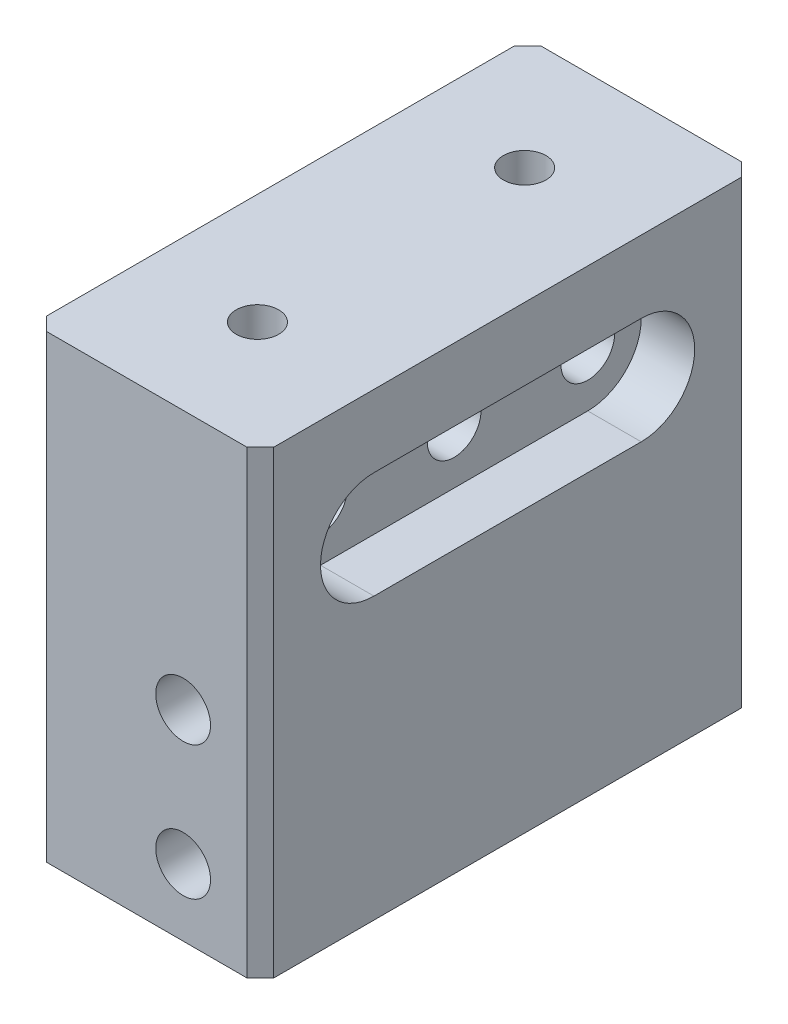
ISO-10303-21;
HEADER;
FILE_DESCRIPTION(('STEP AP214'),'2;1');
FILE_NAME('part.step','',(''),(''),'','','');
FILE_SCHEMA(('AUTOMOTIVE_DESIGN { 1 0 10303 214 1 1 1 1 }'));
ENDSEC;
DATA;
#1=APPLICATION_CONTEXT('core data for automotive mechanical design processes');
#2=APPLICATION_PROTOCOL_DEFINITION('international standard','automotive_design',2000,#1);
#3=PRODUCT_CONTEXT('',#1,'mechanical');
#4=PRODUCT('Part','Part','',(#3));
#5=PRODUCT_RELATED_PRODUCT_CATEGORY('part','',(#4));
#6=PRODUCT_DEFINITION_FORMATION('','',#4);
#7=PRODUCT_DEFINITION_CONTEXT('part definition',#1,'design');
#8=PRODUCT_DEFINITION('design','',#6,#7);
#9=PRODUCT_DEFINITION_SHAPE('','',#8);
#10=(LENGTH_UNIT() NAMED_UNIT(*) SI_UNIT(.MILLI.,.METRE.));
#11=(NAMED_UNIT(*) PLANE_ANGLE_UNIT() SI_UNIT($,.RADIAN.));
#12=(NAMED_UNIT(*) SI_UNIT($,.STERADIAN.) SOLID_ANGLE_UNIT());
#13=UNCERTAINTY_MEASURE_WITH_UNIT(LENGTH_MEASURE(1.E-05),#10,'distance_accuracy_value','');
#14=(GEOMETRIC_REPRESENTATION_CONTEXT(3) GLOBAL_UNCERTAINTY_ASSIGNED_CONTEXT((#13)) GLOBAL_UNIT_ASSIGNED_CONTEXT((#10,
#11,#12)) REPRESENTATION_CONTEXT('',''));
#15=CARTESIAN_POINT('',(0.,0.,0.));
#16=DIRECTION('',(0.,0.,1.));
#17=DIRECTION('',(1.,0.,0.));
#18=AXIS2_PLACEMENT_3D('',#15,#16,#17);
#19=CARTESIAN_POINT('',(-10.795,12.7,0.));
#20=DIRECTION('',(1.,0.,0.));
#21=DIRECTION('',(0.,0.,-1.));
#22=AXIS2_PLACEMENT_3D('',#19,#20,#21);
#23=CYLINDRICAL_SURFACE('',#22,2.5527);
#24=CARTESIAN_POINT('',(-10.795,12.7,0.));
#25=DIRECTION('',(1.,0.,0.));
#26=DIRECTION('',(0.,0.,-1.));
#27=AXIS2_PLACEMENT_3D('',#24,#25,#26);
#28=CIRCLE('',#27,2.5527);
#29=CARTESIAN_POINT('',(-10.795,12.7,-2.5527));
#30=VERTEX_POINT('',#29);
#31=EDGE_CURVE('E180',#30,#30,#28,.T.);
#32=ORIENTED_EDGE('',*,*,#31,.F.);
#33=EDGE_LOOP('',(#32));
#34=FACE_BOUND('',#33,.T.);
#35=CARTESIAN_POINT('',(5.715,12.7,0.));
#36=DIRECTION('',(1.,0.,0.));
#37=DIRECTION('',(0.,0.,-1.));
#38=AXIS2_PLACEMENT_3D('',#35,#36,#37);
#39=CIRCLE('',#38,2.5527);
#40=CARTESIAN_POINT('',(5.715,12.7,-2.5527));
#41=VERTEX_POINT('',#40);
#42=EDGE_CURVE('E177',#41,#41,#39,.F.);
#43=ORIENTED_EDGE('',*,*,#42,.F.);
#44=EDGE_LOOP('',(#43));
#45=FACE_BOUND('',#44,.T.);
#46=ADVANCED_FACE('F37',(#34,#45),#23,.F.);
#47=CARTESIAN_POINT('',(-10.795,12.7,-12.7));
#48=DIRECTION('',(1.,0.,0.));
#49=DIRECTION('',(0.,0.,-1.));
#50=AXIS2_PLACEMENT_3D('',#47,#48,#49);
#51=CYLINDRICAL_SURFACE('',#50,2.5527);
#52=CARTESIAN_POINT('',(-10.795,12.7,-12.7));
#53=DIRECTION('',(1.,0.,0.));
#54=DIRECTION('',(0.,0.,-1.));
#55=AXIS2_PLACEMENT_3D('',#52,#53,#54);
#56=CIRCLE('',#55,2.5527);
#57=CARTESIAN_POINT('',(-10.795,12.7,-15.2527));
#58=VERTEX_POINT('',#57);
#59=EDGE_CURVE('E185',#58,#58,#56,.T.);
#60=ORIENTED_EDGE('',*,*,#59,.F.);
#61=EDGE_LOOP('',(#60));
#62=FACE_BOUND('',#61,.T.);
#63=CARTESIAN_POINT('',(5.715,12.7,-12.7));
#64=DIRECTION('',(1.,0.,0.));
#65=DIRECTION('',(0.,0.,-1.));
#66=AXIS2_PLACEMENT_3D('',#63,#64,#65);
#67=CIRCLE('',#66,2.5527);
#68=CARTESIAN_POINT('',(5.715,12.7,-15.2527));
#69=VERTEX_POINT('',#68);
#70=EDGE_CURVE('E174',#69,#69,#67,.F.);
#71=ORIENTED_EDGE('',*,*,#70,.F.);
#72=EDGE_LOOP('',(#71));
#73=FACE_BOUND('',#72,.T.);
#74=ADVANCED_FACE('F309',(#62,#73),#51,.F.);
#75=CARTESIAN_POINT('',(-10.795,12.7,12.7));
#76=DIRECTION('',(1.,0.,0.));
#77=DIRECTION('',(0.,0.,-1.));
#78=AXIS2_PLACEMENT_3D('',#75,#76,#77);
#79=CYLINDRICAL_SURFACE('',#78,2.5527);
#80=CARTESIAN_POINT('',(-10.795,12.7,12.7));
#81=DIRECTION('',(1.,0.,0.));
#82=DIRECTION('',(0.,0.,-1.));
#83=AXIS2_PLACEMENT_3D('',#80,#81,#82);
#84=CIRCLE('',#83,2.5527);
#85=CARTESIAN_POINT('',(-10.795,12.7,10.1473));
#86=VERTEX_POINT('',#85);
#87=EDGE_CURVE('E181',#86,#86,#84,.T.);
#88=ORIENTED_EDGE('',*,*,#87,.F.);
#89=EDGE_LOOP('',(#88));
#90=FACE_BOUND('',#89,.T.);
#91=CARTESIAN_POINT('',(5.715,12.7,12.7));
#92=DIRECTION('',(1.,0.,0.));
#93=DIRECTION('',(0.,0.,-1.));
#94=AXIS2_PLACEMENT_3D('',#91,#92,#93);
#95=CIRCLE('',#94,2.5527);
#96=CARTESIAN_POINT('',(5.715,12.7,10.1473));
#97=VERTEX_POINT('',#96);
#98=EDGE_CURVE('E170',#97,#97,#95,.F.);
#99=ORIENTED_EDGE('',*,*,#98,.F.);
#100=EDGE_LOOP('',(#99));
#101=FACE_BOUND('',#100,.T.);
#102=ADVANCED_FACE('F315',(#90,#101),#79,.F.);
#103=CARTESIAN_POINT('',(10.795,19.05,23.495));
#104=DIRECTION('',(-1.,0.,0.));
#105=DIRECTION('',(0.,0.,1.));
#106=AXIS2_PLACEMENT_3D('',#103,#104,#105);
#107=PLANE('',#106);
#108=DIRECTION('',(0.,0.,-1.));
#109=VECTOR('',#108,1.);
#110=CARTESIAN_POINT('',(10.795,7.62,12.7));
#111=LINE('',#110,#109);
#112=CARTESIAN_POINT('',(10.795,7.62,12.7));
#113=VERTEX_POINT('',#112);
#114=CARTESIAN_POINT('',(10.795,7.62,-12.7));
#115=VERTEX_POINT('',#114);
#116=EDGE_CURVE('E164',#113,#115,#111,.T.);
#117=ORIENTED_EDGE('',*,*,#116,.F.);
#118=CARTESIAN_POINT('',(10.795,12.7,12.7));
#119=DIRECTION('',(1.,0.,0.));
#120=DIRECTION('',(0.,0.,-1.));
#121=AXIS2_PLACEMENT_3D('',#118,#119,#120);
#122=CIRCLE('',#121,5.08);
#123=CARTESIAN_POINT('',(10.795,17.78,12.7));
#124=VERTEX_POINT('',#123);
#125=EDGE_CURVE('E134',#124,#113,#122,.T.);
#126=ORIENTED_EDGE('',*,*,#125,.F.);
#127=DIRECTION('',(0.,0.,1.));
#128=VECTOR('',#127,1.);
#129=CARTESIAN_POINT('',(10.795,17.78,12.7));
#130=LINE('',#129,#128);
#131=CARTESIAN_POINT('',(10.795,17.78,-12.7));
#132=VERTEX_POINT('',#131);
#133=EDGE_CURVE('E152',#132,#124,#130,.T.);
#134=ORIENTED_EDGE('',*,*,#133,.F.);
#135=CARTESIAN_POINT('',(10.795,12.7,-12.7));
#136=DIRECTION('',(1.,0.,0.));
#137=DIRECTION('',(0.,0.,-1.));
#138=AXIS2_PLACEMENT_3D('',#135,#136,#137);
#139=CIRCLE('',#138,5.08);
#140=EDGE_CURVE('E155',#115,#132,#139,.T.);
#141=ORIENTED_EDGE('',*,*,#140,.F.);
#142=EDGE_LOOP('',(#117,#126,#134,#141));
#143=FACE_BOUND('',#142,.T.);
#144=DIRECTION('',(0.,0.,-1.));
#145=VECTOR('',#144,1.);
#146=CARTESIAN_POINT('',(10.795,24.638,23.495));
#147=LINE('',#146,#145);
#148=CARTESIAN_POINT('',(10.795,24.638,22.225));
#149=VERTEX_POINT('',#148);
#150=CARTESIAN_POINT('',(10.795,24.638,-22.225));
#151=VERTEX_POINT('',#150);
#152=EDGE_CURVE('E266',#149,#151,#147,.T.);
#153=ORIENTED_EDGE('',*,*,#152,.F.);
#154=DIRECTION('',(0.,-1.,0.));
#155=VECTOR('',#154,1.);
#156=CARTESIAN_POINT('',(10.795,19.05,22.225));
#157=LINE('',#156,#155);
#158=CARTESIAN_POINT('',(10.795,-19.05,22.225));
#159=VERTEX_POINT('',#158);
#160=EDGE_CURVE('E241',#149,#159,#157,.T.);
#161=ORIENTED_EDGE('',*,*,#160,.T.);
#162=DIRECTION('',(0.,0.,-1.));
#163=VECTOR('',#162,1.);
#164=CARTESIAN_POINT('',(10.795,-19.05,23.495));
#165=LINE('',#164,#163);
#166=CARTESIAN_POINT('',(10.795,-19.05,-22.225));
#167=VERTEX_POINT('',#166);
#168=EDGE_CURVE('E193',#159,#167,#165,.T.);
#169=ORIENTED_EDGE('',*,*,#168,.T.);
#170=DIRECTION('',(0.,1.,0.));
#171=VECTOR('',#170,1.);
#172=CARTESIAN_POINT('',(10.795,19.05,-22.225));
#173=LINE('',#172,#171);
#174=EDGE_CURVE('E239',#167,#151,#173,.T.);
#175=ORIENTED_EDGE('',*,*,#174,.T.);
#176=EDGE_LOOP('',(#153,#161,#169,#175));
#177=FACE_BOUND('',#176,.T.);
#178=ADVANCED_FACE('F341',(#143,#177),#107,.F.);
#179=CARTESIAN_POINT('',(-10.795,19.05,-23.495));
#180=DIRECTION('',(0.,0.,1.));
#181=DIRECTION('',(1.,0.,0.));
#182=AXIS2_PLACEMENT_3D('',#179,#180,#181);
#183=PLANE('',#182);
#184=CARTESIAN_POINT('',(3.4544,-12.7,-23.495));
#185=DIRECTION('',(0.,0.,1.));
#186=DIRECTION('',(1.,0.,0.));
#187=AXIS2_PLACEMENT_3D('',#184,#185,#186);
#188=CIRCLE('',#187,2.6035);
#189=CARTESIAN_POINT('',(6.05790000000001,-12.7,-23.495));
#190=VERTEX_POINT('',#189);
#191=EDGE_CURVE('E190',#190,#190,#188,.T.);
#192=ORIENTED_EDGE('',*,*,#191,.T.);
#193=EDGE_LOOP('',(#192));
#194=FACE_BOUND('',#193,.T.);
#195=CARTESIAN_POINT('',(3.4544,0.,-23.495));
#196=DIRECTION('',(0.,0.,1.));
#197=DIRECTION('',(1.,0.,0.));
#198=AXIS2_PLACEMENT_3D('',#195,#196,#197);
#199=CIRCLE('',#198,2.6035);
#200=CARTESIAN_POINT('',(6.05790000000001,0.,-23.495));
#201=VERTEX_POINT('',#200);
#202=EDGE_CURVE('E197',#201,#201,#199,.T.);
#203=ORIENTED_EDGE('',*,*,#202,.T.);
#204=EDGE_LOOP('',(#203));
#205=FACE_BOUND('',#204,.T.);
#206=DIRECTION('',(-1.,0.,0.));
#207=VECTOR('',#206,1.);
#208=CARTESIAN_POINT('',(-10.795,-19.05,-23.495));
#209=LINE('',#208,#207);
#210=CARTESIAN_POINT('',(9.52499999999999,-19.05,-23.495));
#211=VERTEX_POINT('',#210);
#212=CARTESIAN_POINT('',(-9.525,-19.05,-23.495));
#213=VERTEX_POINT('',#212);
#214=EDGE_CURVE('E204',#211,#213,#209,.T.);
#215=ORIENTED_EDGE('',*,*,#214,.T.);
#216=DIRECTION('',(0.,1.,0.));
#217=VECTOR('',#216,1.);
#218=CARTESIAN_POINT('',(-9.525,19.05,-23.495));
#219=LINE('',#218,#217);
#220=CARTESIAN_POINT('',(-9.525,24.638,-23.495));
#221=VERTEX_POINT('',#220);
#222=EDGE_CURVE('E11',#213,#221,#219,.T.);
#223=ORIENTED_EDGE('',*,*,#222,.T.);
#224=DIRECTION('',(-1.,0.,0.));
#225=VECTOR('',#224,1.);
#226=CARTESIAN_POINT('',(10.795,24.638,-23.495));
#227=LINE('',#226,#225);
#228=CARTESIAN_POINT('',(9.52499999999999,24.638,-23.495));
#229=VERTEX_POINT('',#228);
#230=EDGE_CURVE('E247',#229,#221,#227,.T.);
#231=ORIENTED_EDGE('',*,*,#230,.F.);
#232=DIRECTION('',(0.,-1.,0.));
#233=VECTOR('',#232,1.);
#234=CARTESIAN_POINT('',(9.52499999999999,19.05,-23.495));
#235=LINE('',#234,#233);
#236=EDGE_CURVE('E46',#229,#211,#235,.T.);
#237=ORIENTED_EDGE('',*,*,#236,.T.);
#238=EDGE_LOOP('',(#215,#223,#231,#237));
#239=FACE_BOUND('',#238,.T.);
#240=ADVANCED_FACE('F246',(#194,#205,#239),#183,.F.);
#241=CARTESIAN_POINT('',(-10.795,19.05,23.495));
#242=DIRECTION('',(1.,0.,0.));
#243=DIRECTION('',(0.,0.,-1.));
#244=AXIS2_PLACEMENT_3D('',#241,#242,#243);
#245=PLANE('',#244);
#246=ORIENTED_EDGE('',*,*,#87,.T.);
#247=EDGE_LOOP('',(#246));
#248=FACE_BOUND('',#247,.T.);
#249=ORIENTED_EDGE('',*,*,#59,.T.);
#250=EDGE_LOOP('',(#249));
#251=FACE_BOUND('',#250,.T.);
#252=ORIENTED_EDGE('',*,*,#31,.T.);
#253=EDGE_LOOP('',(#252));
#254=FACE_BOUND('',#253,.T.);
#255=DIRECTION('',(0.,0.,1.));
#256=VECTOR('',#255,1.);
#257=CARTESIAN_POINT('',(-10.795,-19.05,23.495));
#258=LINE('',#257,#256);
#259=CARTESIAN_POINT('',(-10.795,-19.05,-22.225));
#260=VERTEX_POINT('',#259);
#261=CARTESIAN_POINT('',(-10.795,-19.05,22.225));
#262=VERTEX_POINT('',#261);
#263=EDGE_CURVE('E206',#260,#262,#258,.T.);
#264=ORIENTED_EDGE('',*,*,#263,.T.);
#265=DIRECTION('',(0.,1.,0.));
#266=VECTOR('',#265,1.);
#267=CARTESIAN_POINT('',(-10.795,19.05,22.225));
#268=LINE('',#267,#266);
#269=CARTESIAN_POINT('',(-10.795,24.638,22.225));
#270=VERTEX_POINT('',#269);
#271=EDGE_CURVE('E230',#262,#270,#268,.T.);
#272=ORIENTED_EDGE('',*,*,#271,.T.);
#273=DIRECTION('',(0.,0.,1.));
#274=VECTOR('',#273,1.);
#275=CARTESIAN_POINT('',(-10.795,24.638,-23.495));
#276=LINE('',#275,#274);
#277=CARTESIAN_POINT('',(-10.795,24.638,-22.225));
#278=VERTEX_POINT('',#277);
#279=EDGE_CURVE('E263',#278,#270,#276,.T.);
#280=ORIENTED_EDGE('',*,*,#279,.F.);
#281=DIRECTION('',(0.,-1.,0.));
#282=VECTOR('',#281,1.);
#283=CARTESIAN_POINT('',(-10.795,19.05,-22.225));
#284=LINE('',#283,#282);
#285=EDGE_CURVE('E227',#278,#260,#284,.T.);
#286=ORIENTED_EDGE('',*,*,#285,.T.);
#287=EDGE_LOOP('',(#264,#272,#280,#286));
#288=FACE_BOUND('',#287,.T.);
#289=ADVANCED_FACE('F260',(#248,#251,#254,#288),#245,.F.);
#290=CARTESIAN_POINT('',(-10.795,19.05,23.495));
#291=DIRECTION('',(0.,0.,-1.));
#292=DIRECTION('',(-1.,0.,0.));
#293=AXIS2_PLACEMENT_3D('',#290,#291,#292);
#294=PLANE('',#293);
#295=CARTESIAN_POINT('',(3.4544,-12.7,23.495));
#296=DIRECTION('',(0.,0.,1.));
#297=DIRECTION('',(1.,0.,0.));
#298=AXIS2_PLACEMENT_3D('',#295,#296,#297);
#299=CIRCLE('',#298,2.6035);
#300=CARTESIAN_POINT('',(6.05790000000001,-12.7,23.495));
#301=VERTEX_POINT('',#300);
#302=EDGE_CURVE('E194',#301,#301,#299,.T.);
#303=ORIENTED_EDGE('',*,*,#302,.F.);
#304=EDGE_LOOP('',(#303));
#305=FACE_BOUND('',#304,.T.);
#306=CARTESIAN_POINT('',(3.4544,0.,23.495));
#307=DIRECTION('',(0.,0.,1.));
#308=DIRECTION('',(1.,0.,0.));
#309=AXIS2_PLACEMENT_3D('',#306,#307,#308);
#310=CIRCLE('',#309,2.6035);
#311=CARTESIAN_POINT('',(6.05790000000001,0.,23.495));
#312=VERTEX_POINT('',#311);
#313=EDGE_CURVE('E184',#312,#312,#310,.T.);
#314=ORIENTED_EDGE('',*,*,#313,.F.);
#315=EDGE_LOOP('',(#314));
#316=FACE_BOUND('',#315,.T.);
#317=DIRECTION('',(1.,0.,0.));
#318=VECTOR('',#317,1.);
#319=CARTESIAN_POINT('',(-10.795,24.638,23.495));
#320=LINE('',#319,#318);
#321=CARTESIAN_POINT('',(-9.52499999999999,24.638,23.495));
#322=VERTEX_POINT('',#321);
#323=CARTESIAN_POINT('',(9.52500000000001,24.638,23.495));
#324=VERTEX_POINT('',#323);
#325=EDGE_CURVE('E158',#322,#324,#320,.T.);
#326=ORIENTED_EDGE('',*,*,#325,.F.);
#327=DIRECTION('',(0.,-1.,0.));
#328=VECTOR('',#327,1.);
#329=CARTESIAN_POINT('',(-9.52499999999999,19.05,23.495));
#330=LINE('',#329,#328);
#331=CARTESIAN_POINT('',(-9.52499999999999,-19.05,23.495));
#332=VERTEX_POINT('',#331);
#333=EDGE_CURVE('E216',#322,#332,#330,.T.);
#334=ORIENTED_EDGE('',*,*,#333,.T.);
#335=DIRECTION('',(1.,0.,0.));
#336=VECTOR('',#335,1.);
#337=CARTESIAN_POINT('',(-10.795,-19.05,23.495));
#338=LINE('',#337,#336);
#339=CARTESIAN_POINT('',(9.52500000000001,-19.05,23.495));
#340=VERTEX_POINT('',#339);
#341=EDGE_CURVE('E209',#332,#340,#338,.T.);
#342=ORIENTED_EDGE('',*,*,#341,.T.);
#343=DIRECTION('',(0.,1.,0.));
#344=VECTOR('',#343,1.);
#345=CARTESIAN_POINT('',(9.52500000000001,19.05,23.495));
#346=LINE('',#345,#344);
#347=EDGE_CURVE('E212',#340,#324,#346,.T.);
#348=ORIENTED_EDGE('',*,*,#347,.T.);
#349=EDGE_LOOP('',(#326,#334,#342,#348));
#350=FACE_BOUND('',#349,.T.);
#351=ADVANCED_FACE('F332',(#305,#316,#350),#294,.F.);
#352=CARTESIAN_POINT('',(0.,-19.05,0.));
#353=DIRECTION('',(0.,-1.,0.));
#354=DIRECTION('',(0.,0.,-1.));
#355=AXIS2_PLACEMENT_3D('',#352,#353,#354);
#356=PLANE('',#355);
#357=ORIENTED_EDGE('',*,*,#341,.F.);
#358=DIRECTION('',(0.707106781186546,0.,0.707106781186549));
#359=VECTOR('',#358,1.);
#360=CARTESIAN_POINT('',(-16.51,-19.05,16.5099999999999));
#361=LINE('',#360,#359);
#362=EDGE_CURVE('E225',#332,#262,#361,.F.);
#363=ORIENTED_EDGE('',*,*,#362,.T.);
#364=ORIENTED_EDGE('',*,*,#263,.F.);
#365=DIRECTION('',(-0.707106781186546,0.,0.70710678118655));
#366=VECTOR('',#365,1.);
#367=CARTESIAN_POINT('',(-16.51,-19.05,-16.5099999999999));
#368=LINE('',#367,#366);
#369=EDGE_CURVE('E221',#260,#213,#368,.F.);
#370=ORIENTED_EDGE('',*,*,#369,.T.);
#371=ORIENTED_EDGE('',*,*,#214,.F.);
#372=DIRECTION('',(-0.707106781186545,0.,-0.70710678118655));
#373=VECTOR('',#372,1.);
#374=CARTESIAN_POINT('',(16.51,-19.05,-16.5099999999999));
#375=LINE('',#374,#373);
#376=EDGE_CURVE('E219',#211,#167,#375,.F.);
#377=ORIENTED_EDGE('',*,*,#376,.T.);
#378=ORIENTED_EDGE('',*,*,#168,.F.);
#379=DIRECTION('',(0.707106781186548,0.,-0.707106781186547));
#380=VECTOR('',#379,1.);
#381=CARTESIAN_POINT('',(16.51,-19.05,16.51));
#382=LINE('',#381,#380);
#383=EDGE_CURVE('E223',#159,#340,#382,.F.);
#384=ORIENTED_EDGE('',*,*,#383,.T.);
#385=EDGE_LOOP('',(#357,#363,#364,#370,#371,#377,#378,#384));
#386=FACE_BOUND('',#385,.T.);
#387=ADVANCED_FACE('F251',(#386),#356,.T.);
#388=CARTESIAN_POINT('',(3.4544,0.,-23.495));
#389=DIRECTION('',(0.,0.,1.));
#390=DIRECTION('',(1.,0.,0.));
#391=AXIS2_PLACEMENT_3D('',#388,#389,#390);
#392=CYLINDRICAL_SURFACE('',#391,2.6035);
#393=ORIENTED_EDGE('',*,*,#202,.F.);
#394=EDGE_LOOP('',(#393));
#395=FACE_BOUND('',#394,.T.);
#396=ORIENTED_EDGE('',*,*,#313,.T.);
#397=EDGE_LOOP('',(#396));
#398=FACE_BOUND('',#397,.T.);
#399=ADVANCED_FACE('F325',(#395,#398),#392,.F.);
#400=CARTESIAN_POINT('',(3.4544,-12.7,-23.495));
#401=DIRECTION('',(0.,0.,1.));
#402=DIRECTION('',(1.,0.,0.));
#403=AXIS2_PLACEMENT_3D('',#400,#401,#402);
#404=CYLINDRICAL_SURFACE('',#403,2.6035);
#405=ORIENTED_EDGE('',*,*,#191,.F.);
#406=EDGE_LOOP('',(#405));
#407=FACE_BOUND('',#406,.T.);
#408=ORIENTED_EDGE('',*,*,#302,.T.);
#409=EDGE_LOOP('',(#408));
#410=FACE_BOUND('',#409,.T.);
#411=ADVANCED_FACE('F322',(#407,#410),#404,.F.);
#412=CARTESIAN_POINT('',(5.715,12.7,12.7));
#413=DIRECTION('',(1.,0.,0.));
#414=DIRECTION('',(0.,0.,-1.));
#415=AXIS2_PLACEMENT_3D('',#412,#413,#414);
#416=PLANE('',#415);
#417=CARTESIAN_POINT('',(5.715,12.7,12.7));
#418=DIRECTION('',(1.,0.,0.));
#419=DIRECTION('',(0.,0.,-1.));
#420=AXIS2_PLACEMENT_3D('',#417,#418,#419);
#421=CIRCLE('',#420,5.08);
#422=CARTESIAN_POINT('',(5.715,17.78,12.7));
#423=VERTEX_POINT('',#422);
#424=CARTESIAN_POINT('',(5.715,7.62,12.7));
#425=VERTEX_POINT('',#424);
#426=EDGE_CURVE('E131',#423,#425,#421,.T.);
#427=ORIENTED_EDGE('',*,*,#426,.T.);
#428=DIRECTION('',(0.,0.,-1.));
#429=VECTOR('',#428,1.);
#430=CARTESIAN_POINT('',(5.715,7.62,12.7));
#431=LINE('',#430,#429);
#432=CARTESIAN_POINT('',(5.715,7.62,-12.7));
#433=VERTEX_POINT('',#432);
#434=EDGE_CURVE('E142',#425,#433,#431,.T.);
#435=ORIENTED_EDGE('',*,*,#434,.T.);
#436=CARTESIAN_POINT('',(5.715,12.7,-12.7));
#437=DIRECTION('',(1.,0.,0.));
#438=DIRECTION('',(0.,0.,-1.));
#439=AXIS2_PLACEMENT_3D('',#436,#437,#438);
#440=CIRCLE('',#439,5.08);
#441=CARTESIAN_POINT('',(5.715,17.78,-12.7));
#442=VERTEX_POINT('',#441);
#443=EDGE_CURVE('E147',#433,#442,#440,.T.);
#444=ORIENTED_EDGE('',*,*,#443,.T.);
#445=DIRECTION('',(0.,0.,1.));
#446=VECTOR('',#445,1.);
#447=CARTESIAN_POINT('',(5.715,17.78,12.7));
#448=LINE('',#447,#446);
#449=EDGE_CURVE('E139',#442,#423,#448,.T.);
#450=ORIENTED_EDGE('',*,*,#449,.T.);
#451=EDGE_LOOP('',(#427,#435,#444,#450));
#452=FACE_BOUND('',#451,.T.);
#453=ORIENTED_EDGE('',*,*,#98,.T.);
#454=EDGE_LOOP('',(#453));
#455=FACE_BOUND('',#454,.T.);
#456=ORIENTED_EDGE('',*,*,#70,.T.);
#457=EDGE_LOOP('',(#456));
#458=FACE_BOUND('',#457,.T.);
#459=ORIENTED_EDGE('',*,*,#42,.T.);
#460=EDGE_LOOP('',(#459));
#461=FACE_BOUND('',#460,.T.);
#462=ADVANCED_FACE('F149',(#452,#455,#458,#461),#416,.T.);
#463=CARTESIAN_POINT('',(5.715,12.7,12.7));
#464=DIRECTION('',(1.,0.,0.));
#465=DIRECTION('',(0.,0.,-1.));
#466=AXIS2_PLACEMENT_3D('',#463,#464,#465);
#467=CYLINDRICAL_SURFACE('',#466,5.08);
#468=ORIENTED_EDGE('',*,*,#125,.T.);
#469=DIRECTION('',(1.,0.,0.));
#470=VECTOR('',#469,1.);
#471=CARTESIAN_POINT('',(5.715,7.62,12.7));
#472=LINE('',#471,#470);
#473=EDGE_CURVE('E127',#425,#113,#472,.T.);
#474=ORIENTED_EDGE('',*,*,#473,.F.);
#475=ORIENTED_EDGE('',*,*,#426,.F.);
#476=DIRECTION('',(1.,0.,0.));
#477=VECTOR('',#476,1.);
#478=CARTESIAN_POINT('',(5.715,17.78,12.7));
#479=LINE('',#478,#477);
#480=EDGE_CURVE('E168',#423,#124,#479,.T.);
#481=ORIENTED_EDGE('',*,*,#480,.T.);
#482=EDGE_LOOP('',(#468,#474,#475,#481));
#483=FACE_BOUND('',#482,.T.);
#484=ADVANCED_FACE('F129',(#483),#467,.F.);
#485=CARTESIAN_POINT('',(5.715,17.78,12.7));
#486=DIRECTION('',(0.,1.,0.));
#487=DIRECTION('',(0.,0.,1.));
#488=AXIS2_PLACEMENT_3D('',#485,#486,#487);
#489=PLANE('',#488);
#490=ORIENTED_EDGE('',*,*,#133,.T.);
#491=ORIENTED_EDGE('',*,*,#480,.F.);
#492=ORIENTED_EDGE('',*,*,#449,.F.);
#493=DIRECTION('',(1.,0.,0.));
#494=VECTOR('',#493,1.);
#495=CARTESIAN_POINT('',(5.715,17.78,-12.7));
#496=LINE('',#495,#494);
#497=EDGE_CURVE('E171',#442,#132,#496,.T.);
#498=ORIENTED_EDGE('',*,*,#497,.T.);
#499=EDGE_LOOP('',(#490,#491,#492,#498));
#500=FACE_BOUND('',#499,.T.);
#501=ADVANCED_FACE('F477',(#500),#489,.F.);
#502=CARTESIAN_POINT('',(5.715,12.7,-12.7));
#503=DIRECTION('',(1.,0.,0.));
#504=DIRECTION('',(0.,0.,-1.));
#505=AXIS2_PLACEMENT_3D('',#502,#503,#504);
#506=CYLINDRICAL_SURFACE('',#505,5.08);
#507=ORIENTED_EDGE('',*,*,#140,.T.);
#508=ORIENTED_EDGE('',*,*,#497,.F.);
#509=ORIENTED_EDGE('',*,*,#443,.F.);
#510=DIRECTION('',(1.,0.,0.));
#511=VECTOR('',#510,1.);
#512=CARTESIAN_POINT('',(5.715,7.62,-12.7));
#513=LINE('',#512,#511);
#514=EDGE_CURVE('E138',#433,#115,#513,.T.);
#515=ORIENTED_EDGE('',*,*,#514,.T.);
#516=EDGE_LOOP('',(#507,#508,#509,#515));
#517=FACE_BOUND('',#516,.T.);
#518=ADVANCED_FACE('F468',(#517),#506,.F.);
#519=CARTESIAN_POINT('',(5.715,7.62,12.7));
#520=DIRECTION('',(0.,-1.,0.));
#521=DIRECTION('',(0.,0.,-1.));
#522=AXIS2_PLACEMENT_3D('',#519,#520,#521);
#523=PLANE('',#522);
#524=ORIENTED_EDGE('',*,*,#116,.T.);
#525=ORIENTED_EDGE('',*,*,#514,.F.);
#526=ORIENTED_EDGE('',*,*,#434,.F.);
#527=ORIENTED_EDGE('',*,*,#473,.T.);
#528=EDGE_LOOP('',(#524,#525,#526,#527));
#529=FACE_BOUND('',#528,.T.);
#530=ADVANCED_FACE('F143',(#529),#523,.F.);
#531=CARTESIAN_POINT('',(0.,24.638,0.));
#532=DIRECTION('',(0.,1.,0.));
#533=DIRECTION('',(0.,0.,1.));
#534=AXIS2_PLACEMENT_3D('',#531,#532,#533);
#535=PLANE('',#534);
#536=CARTESIAN_POINT('',(-0.279400000000002,24.638,-12.6969262280286));
#537=DIRECTION('',(0.,1.,0.));
#538=DIRECTION('',(0.,0.,1.));
#539=AXIS2_PLACEMENT_3D('',#536,#537,#538);
#540=CIRCLE('',#539,2.0193);
#541=CARTESIAN_POINT('',(-0.279400000000002,24.638,-10.6776262280286));
#542=VERTEX_POINT('',#541);
#543=EDGE_CURVE('E277',#542,#542,#540,.T.);
#544=ORIENTED_EDGE('',*,*,#543,.F.);
#545=EDGE_LOOP('',(#544));
#546=FACE_BOUND('',#545,.T.);
#547=CARTESIAN_POINT('',(-0.279400000000002,24.638,12.6969262280286));
#548=DIRECTION('',(0.,1.,0.));
#549=DIRECTION('',(0.,0.,-1.));
#550=AXIS2_PLACEMENT_3D('',#547,#548,#549);
#551=CIRCLE('',#550,2.0193);
#552=CARTESIAN_POINT('',(-0.279400000000002,24.638,10.6776262280286));
#553=VERTEX_POINT('',#552);
#554=EDGE_CURVE('E271',#553,#553,#551,.T.);
#555=ORIENTED_EDGE('',*,*,#554,.F.);
#556=EDGE_LOOP('',(#555));
#557=FACE_BOUND('',#556,.T.);
#558=ORIENTED_EDGE('',*,*,#279,.T.);
#559=DIRECTION('',(-0.707106781186546,0.,-0.707106781186549));
#560=VECTOR('',#559,1.);
#561=CARTESIAN_POINT('',(-16.51,24.638,16.5099999999999));
#562=LINE('',#561,#560);
#563=EDGE_CURVE('E237',#270,#322,#562,.F.);
#564=ORIENTED_EDGE('',*,*,#563,.T.);
#565=ORIENTED_EDGE('',*,*,#325,.T.);
#566=DIRECTION('',(-0.707106781186548,0.,0.707106781186547));
#567=VECTOR('',#566,1.);
#568=CARTESIAN_POINT('',(16.51,24.638,16.51));
#569=LINE('',#568,#567);
#570=EDGE_CURVE('E235',#324,#149,#569,.F.);
#571=ORIENTED_EDGE('',*,*,#570,.T.);
#572=ORIENTED_EDGE('',*,*,#152,.T.);
#573=DIRECTION('',(0.707106781186545,0.,0.70710678118655));
#574=VECTOR('',#573,1.);
#575=CARTESIAN_POINT('',(16.51,24.638,-16.5099999999999));
#576=LINE('',#575,#574);
#577=EDGE_CURVE('E58',#151,#229,#576,.F.);
#578=ORIENTED_EDGE('',*,*,#577,.T.);
#579=ORIENTED_EDGE('',*,*,#230,.T.);
#580=DIRECTION('',(0.707106781186546,0.,-0.70710678118655));
#581=VECTOR('',#580,1.);
#582=CARTESIAN_POINT('',(-16.51,24.638,-16.5099999999999));
#583=LINE('',#582,#581);
#584=EDGE_CURVE('E233',#221,#278,#583,.F.);
#585=ORIENTED_EDGE('',*,*,#584,.T.);
#586=EDGE_LOOP('',(#558,#564,#565,#571,#572,#578,#579,#585));
#587=FACE_BOUND('',#586,.T.);
#588=ADVANCED_FACE('F292',(#546,#557,#587),#535,.T.);
#589=CARTESIAN_POINT('',(-0.279400000000002,19.558,12.6969262280286));
#590=DIRECTION('',(0.,1.,0.));
#591=DIRECTION('',(0.,0.,1.));
#592=AXIS2_PLACEMENT_3D('',#589,#590,#591);
#593=CYLINDRICAL_SURFACE('',#592,2.0193);
#594=CARTESIAN_POINT('',(-0.279400000000002,19.558,12.6969262280286));
#595=DIRECTION('',(0.,1.,0.));
#596=DIRECTION('',(0.,0.,-1.));
#597=AXIS2_PLACEMENT_3D('',#594,#595,#596);
#598=CIRCLE('',#597,2.0193);
#599=CARTESIAN_POINT('',(-0.279400000000002,19.558,10.6776262280286));
#600=VERTEX_POINT('',#599);
#601=EDGE_CURVE('E274',#600,#600,#598,.T.);
#602=ORIENTED_EDGE('',*,*,#601,.F.);
#603=EDGE_LOOP('',(#602));
#604=FACE_BOUND('',#603,.T.);
#605=ORIENTED_EDGE('',*,*,#554,.T.);
#606=EDGE_LOOP('',(#605));
#607=FACE_BOUND('',#606,.T.);
#608=ADVANCED_FACE('F295',(#604,#607),#593,.F.);
#609=CARTESIAN_POINT('',(-0.279400000000002,19.558,12.6969262280286));
#610=DIRECTION('',(0.,-1.,0.));
#611=DIRECTION('',(0.,0.,-1.));
#612=AXIS2_PLACEMENT_3D('',#609,#610,#611);
#613=PLANE('',#612);
#614=ORIENTED_EDGE('',*,*,#601,.T.);
#615=EDGE_LOOP('',(#614));
#616=FACE_BOUND('',#615,.T.);
#617=ADVANCED_FACE('F288',(#616),#613,.F.);
#618=CARTESIAN_POINT('',(-0.279400000000002,19.558,-12.6969262280286));
#619=DIRECTION('',(0.,1.,0.));
#620=DIRECTION('',(0.,0.,1.));
#621=AXIS2_PLACEMENT_3D('',#618,#619,#620);
#622=CYLINDRICAL_SURFACE('',#621,2.0193);
#623=CARTESIAN_POINT('',(-0.279400000000002,19.558,-12.6969262280286));
#624=DIRECTION('',(0.,1.,0.));
#625=DIRECTION('',(0.,0.,1.));
#626=AXIS2_PLACEMENT_3D('',#623,#624,#625);
#627=CIRCLE('',#626,2.0193);
#628=CARTESIAN_POINT('',(-0.279400000000002,19.558,-10.6776262280286));
#629=VERTEX_POINT('',#628);
#630=EDGE_CURVE('E270',#629,#629,#627,.T.);
#631=ORIENTED_EDGE('',*,*,#630,.F.);
#632=EDGE_LOOP('',(#631));
#633=FACE_BOUND('',#632,.T.);
#634=ORIENTED_EDGE('',*,*,#543,.T.);
#635=EDGE_LOOP('',(#634));
#636=FACE_BOUND('',#635,.T.);
#637=ADVANCED_FACE('F285',(#633,#636),#622,.F.);
#638=CARTESIAN_POINT('',(-0.279400000000002,19.558,-12.6969262280286));
#639=DIRECTION('',(0.,1.,0.));
#640=DIRECTION('',(0.,0.,1.));
#641=AXIS2_PLACEMENT_3D('',#638,#639,#640);
#642=PLANE('',#641);
#643=ORIENTED_EDGE('',*,*,#630,.T.);
#644=EDGE_LOOP('',(#643));
#645=FACE_BOUND('',#644,.T.);
#646=ADVANCED_FACE('F283',(#645),#642,.T.);
#647=CARTESIAN_POINT('',(-9.52499999999999,19.05,23.495));
#648=DIRECTION('',(0.707106781186549,0.,-0.707106781186545));
#649=DIRECTION('',(0.,-1.,0.));
#650=AXIS2_PLACEMENT_3D('',#647,#648,#649);
#651=PLANE('',#650);
#652=ORIENTED_EDGE('',*,*,#563,.F.);
#653=ORIENTED_EDGE('',*,*,#271,.F.);
#654=ORIENTED_EDGE('',*,*,#362,.F.);
#655=ORIENTED_EDGE('',*,*,#333,.F.);
#656=EDGE_LOOP('',(#652,#653,#654,#655));
#657=FACE_BOUND('',#656,.T.);
#658=ADVANCED_FACE('F347',(#657),#651,.F.);
#659=CARTESIAN_POINT('',(10.795,19.05,22.225));
#660=DIRECTION('',(-0.707106781186547,0.,-0.707106781186548));
#661=DIRECTION('',(0.,-1.,0.));
#662=AXIS2_PLACEMENT_3D('',#659,#660,#661);
#663=PLANE('',#662);
#664=ORIENTED_EDGE('',*,*,#570,.F.);
#665=ORIENTED_EDGE('',*,*,#347,.F.);
#666=ORIENTED_EDGE('',*,*,#383,.F.);
#667=ORIENTED_EDGE('',*,*,#160,.F.);
#668=EDGE_LOOP('',(#664,#665,#666,#667));
#669=FACE_BOUND('',#668,.T.);
#670=ADVANCED_FACE('F353',(#669),#663,.F.);
#671=CARTESIAN_POINT('',(-10.795,19.05,-22.225));
#672=DIRECTION('',(0.70710678118655,0.,0.707106781186546));
#673=DIRECTION('',(0.,-1.,0.));
#674=AXIS2_PLACEMENT_3D('',#671,#672,#673);
#675=PLANE('',#674);
#676=ORIENTED_EDGE('',*,*,#584,.F.);
#677=ORIENTED_EDGE('',*,*,#222,.F.);
#678=ORIENTED_EDGE('',*,*,#369,.F.);
#679=ORIENTED_EDGE('',*,*,#285,.F.);
#680=EDGE_LOOP('',(#676,#677,#678,#679));
#681=FACE_BOUND('',#680,.T.);
#682=ADVANCED_FACE('F257',(#681),#675,.F.);
#683=CARTESIAN_POINT('',(9.52499999999999,19.05,-23.495));
#684=DIRECTION('',(-0.70710678118655,0.,0.707106781186545));
#685=DIRECTION('',(0.,-1.,0.));
#686=AXIS2_PLACEMENT_3D('',#683,#684,#685);
#687=PLANE('',#686);
#688=ORIENTED_EDGE('',*,*,#577,.F.);
#689=ORIENTED_EDGE('',*,*,#174,.F.);
#690=ORIENTED_EDGE('',*,*,#376,.F.);
#691=ORIENTED_EDGE('',*,*,#236,.F.);
#692=EDGE_LOOP('',(#688,#689,#690,#691));
#693=FACE_BOUND('',#692,.T.);
#694=ADVANCED_FACE('F40',(#693),#687,.F.);
#695=CLOSED_SHELL('',(#46,#74,#102,#178,#240,#289,#351,#387,#399,#411,#462,#484,#501,#518,#530,
#588,#608,#617,#637,#646,#658,#670,#682,#694));
#696=MANIFOLD_SOLID_BREP('B2',#695);
#697=ADVANCED_BREP_SHAPE_REPRESENTATION('',(#18,#696),#14);
#698=SHAPE_DEFINITION_REPRESENTATION(#9,#697);
ENDSEC;
END-ISO-10303-21;
